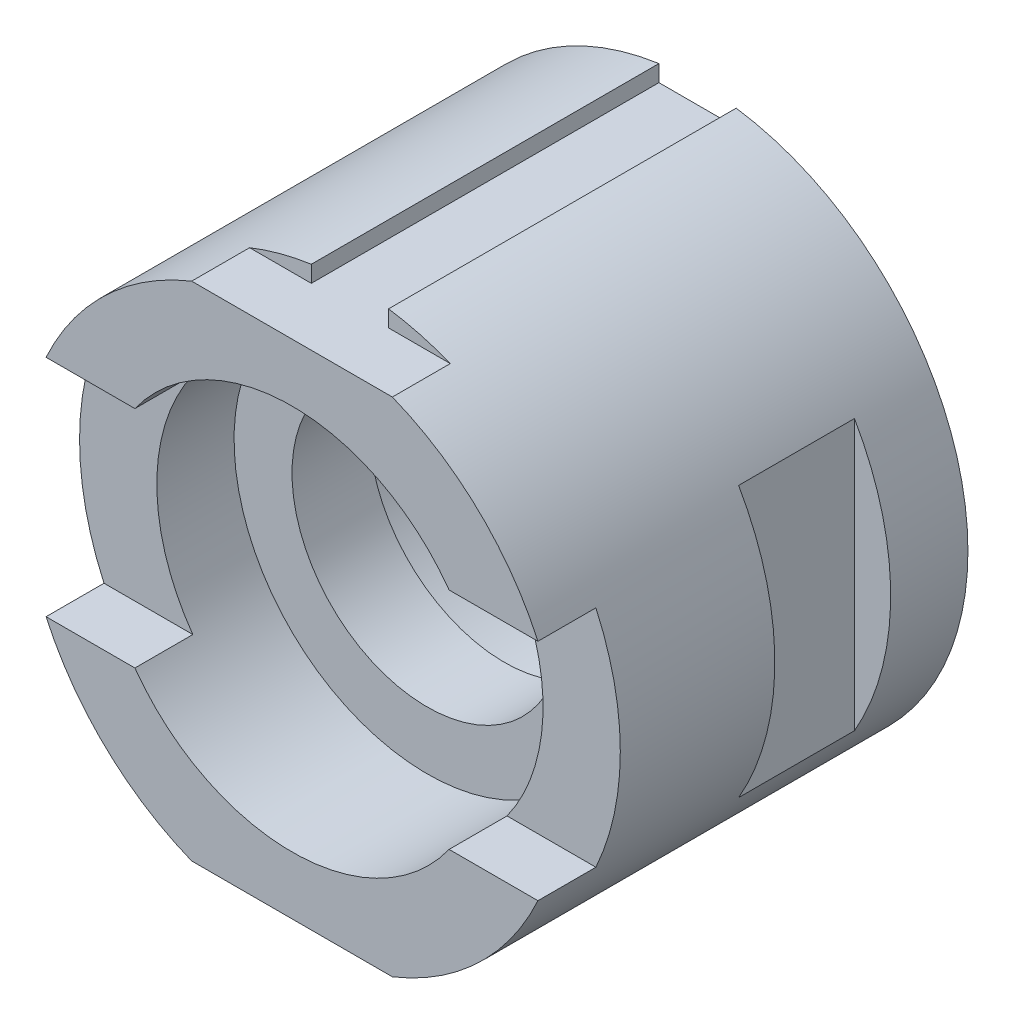
ISO-10303-21;
HEADER;
FILE_DESCRIPTION(('STEP AP214'),'2;1');
FILE_NAME('part.step','',(''),(''),'','','');
FILE_SCHEMA(('AUTOMOTIVE_DESIGN { 1 0 10303 214 1 1 1 1 }'));
ENDSEC;
DATA;
#1=APPLICATION_CONTEXT('core data for automotive mechanical design processes');
#2=APPLICATION_PROTOCOL_DEFINITION('international standard','automotive_design',2000,#1);
#3=PRODUCT_CONTEXT('',#1,'mechanical');
#4=PRODUCT('Part','Part','',(#3));
#5=PRODUCT_RELATED_PRODUCT_CATEGORY('part','',(#4));
#6=PRODUCT_DEFINITION_FORMATION('','',#4);
#7=PRODUCT_DEFINITION_CONTEXT('part definition',#1,'design');
#8=PRODUCT_DEFINITION('design','',#6,#7);
#9=PRODUCT_DEFINITION_SHAPE('','',#8);
#10=(LENGTH_UNIT() NAMED_UNIT(*) SI_UNIT(.MILLI.,.METRE.));
#11=(NAMED_UNIT(*) PLANE_ANGLE_UNIT() SI_UNIT($,.RADIAN.));
#12=(NAMED_UNIT(*) SI_UNIT($,.STERADIAN.) SOLID_ANGLE_UNIT());
#13=UNCERTAINTY_MEASURE_WITH_UNIT(LENGTH_MEASURE(1.E-05),#10,'distance_accuracy_value','');
#14=(GEOMETRIC_REPRESENTATION_CONTEXT(3) GLOBAL_UNCERTAINTY_ASSIGNED_CONTEXT((#13)) GLOBAL_UNIT_ASSIGNED_CONTEXT((#10,
#11,#12)) REPRESENTATION_CONTEXT('',''));
#15=CARTESIAN_POINT('',(0.,0.,0.));
#16=DIRECTION('',(0.,0.,1.));
#17=DIRECTION('',(1.,0.,0.));
#18=AXIS2_PLACEMENT_3D('',#15,#16,#17);
#19=CARTESIAN_POINT('',(0.,0.,10.));
#20=DIRECTION('',(0.,0.,-1.));
#21=DIRECTION('',(-1.,0.,0.));
#22=AXIS2_PLACEMENT_3D('',#19,#20,#21);
#23=CYLINDRICAL_SURFACE('',#22,35.);
#24=CARTESIAN_POINT('',(0.,0.,45.));
#25=DIRECTION('',(0.,0.,1.));
#26=DIRECTION('',(1.,0.,0.));
#27=AXIS2_PLACEMENT_3D('',#24,#25,#26);
#28=CIRCLE('',#27,35.);
#29=CARTESIAN_POINT('',(4.99999999999999,-34.6410161513775,45.));
#30=VERTEX_POINT('',#29);
#31=CARTESIAN_POINT('',(12.9903810567667,-32.4999999999999,45.));
#32=VERTEX_POINT('',#31);
#33=EDGE_CURVE('E275',#30,#32,#28,.T.);
#34=ORIENTED_EDGE('',*,*,#33,.F.);
#35=DIRECTION('',(0.,0.,1.));
#36=VECTOR('',#35,1.);
#37=CARTESIAN_POINT('',(4.99999999999999,-34.6410161513775,-46.));
#38=LINE('',#37,#36);
#39=CARTESIAN_POINT('',(4.99999999999999,-34.6410161513775,0.));
#40=VERTEX_POINT('',#39);
#41=EDGE_CURVE('E47',#40,#30,#38,.T.);
#42=ORIENTED_EDGE('',*,*,#41,.F.);
#43=CARTESIAN_POINT('',(0.,0.,0.));
#44=DIRECTION('',(0.,0.,1.));
#45=DIRECTION('',(1.,0.,0.));
#46=AXIS2_PLACEMENT_3D('',#43,#44,#45);
#47=CIRCLE('',#46,35.);
#48=CARTESIAN_POINT('',(5.00000000000002,34.6410161513775,0.));
#49=VERTEX_POINT('',#48);
#50=EDGE_CURVE('E400',#40,#49,#47,.T.);
#51=ORIENTED_EDGE('',*,*,#50,.T.);
#52=DIRECTION('',(0.,0.,1.));
#53=VECTOR('',#52,1.);
#54=CARTESIAN_POINT('',(5.00000000000002,34.6410161513775,-46.));
#55=LINE('',#54,#53);
#56=CARTESIAN_POINT('',(5.00000000000002,34.6410161513775,45.));
#57=VERTEX_POINT('',#56);
#58=EDGE_CURVE('E238',#49,#57,#55,.T.);
#59=ORIENTED_EDGE('',*,*,#58,.T.);
#60=CARTESIAN_POINT('',(0.,-5.03069808033274E-13,45.));
#61=DIRECTION('',(0.,0.,1.));
#62=DIRECTION('',(-1.,0.,0.));
#63=AXIS2_PLACEMENT_3D('',#60,#61,#62);
#64=CIRCLE('',#63,35.0000000000005);
#65=CARTESIAN_POINT('',(12.9903810567664,32.5000000000001,45.));
#66=VERTEX_POINT('',#65);
#67=EDGE_CURVE('E256',#66,#57,#64,.T.);
#68=ORIENTED_EDGE('',*,*,#67,.F.);
#69=DIRECTION('',(0.,0.,1.));
#70=VECTOR('',#69,1.);
#71=CARTESIAN_POINT('',(12.9903810567664,32.5000000000001,45.));
#72=LINE('',#71,#70);
#73=CARTESIAN_POINT('',(12.9903810567664,32.5000000000001,52.5));
#74=VERTEX_POINT('',#73);
#75=EDGE_CURVE('E266',#66,#74,#72,.T.);
#76=ORIENTED_EDGE('',*,*,#75,.T.);
#77=CARTESIAN_POINT('',(0.,0.,52.5));
#78=DIRECTION('',(0.,0.,1.));
#79=DIRECTION('',(-1.,0.,0.));
#80=AXIS2_PLACEMENT_3D('',#77,#78,#79);
#81=CIRCLE('',#80,35.);
#82=CARTESIAN_POINT('',(31.8369565217392,14.5398830611835,52.5));
#83=VERTEX_POINT('',#82);
#84=EDGE_CURVE('E310',#83,#74,#81,.T.);
#85=ORIENTED_EDGE('',*,*,#84,.F.);
#86=DIRECTION('',(0.,0.,-1.));
#87=VECTOR('',#86,1.);
#88=CARTESIAN_POINT('',(31.8369565217392,14.5398830611835,52.5));
#89=LINE('',#88,#87);
#90=CARTESIAN_POINT('',(31.8369565217392,14.5398830611835,45.));
#91=VERTEX_POINT('',#90);
#92=EDGE_CURVE('E320',#83,#91,#89,.T.);
#93=ORIENTED_EDGE('',*,*,#92,.T.);
#94=CARTESIAN_POINT('',(0.,0.,45.));
#95=DIRECTION('',(0.,0.,1.));
#96=DIRECTION('',(1.,0.,0.));
#97=AXIS2_PLACEMENT_3D('',#94,#95,#96);
#98=CIRCLE('',#97,35.);
#99=CARTESIAN_POINT('',(31.8369565217392,-14.5398830611835,45.));
#100=VERTEX_POINT('',#99);
#101=EDGE_CURVE('E355',#100,#91,#98,.T.);
#102=ORIENTED_EDGE('',*,*,#101,.F.);
#103=DIRECTION('',(0.,0.,-1.));
#104=VECTOR('',#103,1.);
#105=CARTESIAN_POINT('',(31.8369565217392,-14.5398830611835,52.5));
#106=LINE('',#105,#104);
#107=CARTESIAN_POINT('',(31.8369565217392,-14.5398830611835,52.5));
#108=VERTEX_POINT('',#107);
#109=EDGE_CURVE('E307',#108,#100,#106,.T.);
#110=ORIENTED_EDGE('',*,*,#109,.F.);
#111=CARTESIAN_POINT('',(0.,0.,52.5));
#112=DIRECTION('',(0.,0.,1.));
#113=DIRECTION('',(1.,0.,0.));
#114=AXIS2_PLACEMENT_3D('',#111,#112,#113);
#115=CIRCLE('',#114,35.);
#116=CARTESIAN_POINT('',(12.9903810567667,-32.4999999999999,52.5));
#117=VERTEX_POINT('',#116);
#118=EDGE_CURVE('E290',#117,#108,#115,.T.);
#119=ORIENTED_EDGE('',*,*,#118,.F.);
#120=DIRECTION('',(0.,0.,1.));
#121=VECTOR('',#120,1.);
#122=CARTESIAN_POINT('',(12.9903810567667,-32.4999999999999,45.));
#123=LINE('',#122,#121);
#124=EDGE_CURVE('E279',#32,#117,#123,.T.);
#125=ORIENTED_EDGE('',*,*,#124,.F.);
#126=EDGE_LOOP('',(#34,#42,#51,#59,#68,#76,#85,#93,#102,#110,#119,#125));
#127=FACE_BOUND('',#126,.T.);
#128=DIRECTION('',(0.,0.,-1.));
#129=VECTOR('',#128,1.);
#130=CARTESIAN_POINT('',(30.3108891324554,17.5,10.));
#131=LINE('',#130,#129);
#132=CARTESIAN_POINT('',(30.3108891324554,17.5,25.));
#133=VERTEX_POINT('',#132);
#134=CARTESIAN_POINT('',(30.3108891324554,17.5,10.));
#135=VERTEX_POINT('',#134);
#136=EDGE_CURVE('E40',#133,#135,#131,.T.);
#137=ORIENTED_EDGE('',*,*,#136,.T.);
#138=CARTESIAN_POINT('',(0.,0.,10.));
#139=DIRECTION('',(0.,0.,1.));
#140=DIRECTION('',(1.,0.,0.));
#141=AXIS2_PLACEMENT_3D('',#138,#139,#140);
#142=CIRCLE('',#141,35.);
#143=CARTESIAN_POINT('',(30.3108891324554,-17.5,10.));
#144=VERTEX_POINT('',#143);
#145=EDGE_CURVE('E11',#144,#135,#142,.T.);
#146=ORIENTED_EDGE('',*,*,#145,.F.);
#147=DIRECTION('',(0.,0.,-1.));
#148=VECTOR('',#147,1.);
#149=CARTESIAN_POINT('',(30.3108891324554,-17.5,10.));
#150=LINE('',#149,#148);
#151=CARTESIAN_POINT('',(30.3108891324554,-17.5,25.));
#152=VERTEX_POINT('',#151);
#153=EDGE_CURVE('E197',#144,#152,#150,.F.);
#154=ORIENTED_EDGE('',*,*,#153,.T.);
#155=CARTESIAN_POINT('',(0.,0.,25.));
#156=DIRECTION('',(0.,0.,-1.));
#157=DIRECTION('',(-1.,0.,0.));
#158=AXIS2_PLACEMENT_3D('',#155,#156,#157);
#159=CIRCLE('',#158,35.);
#160=EDGE_CURVE('E194',#133,#152,#159,.T.);
#161=ORIENTED_EDGE('',*,*,#160,.F.);
#162=EDGE_LOOP('',(#137,#146,#154,#161));
#163=FACE_BOUND('',#162,.T.);
#164=ADVANCED_FACE('F33',(#127,#163),#23,.T.);
#165=CARTESIAN_POINT('',(0.,0.,10.));
#166=DIRECTION('',(0.,0.,1.));
#167=DIRECTION('',(1.,0.,0.));
#168=AXIS2_PLACEMENT_3D('',#165,#166,#167);
#169=CIRCLE('',#168,35.);
#170=CARTESIAN_POINT('',(-30.3108891324554,17.5,10.));
#171=VERTEX_POINT('',#170);
#172=CARTESIAN_POINT('',(-30.3108891324554,-17.5,10.));
#173=VERTEX_POINT('',#172);
#174=EDGE_CURVE('E368',#171,#173,#169,.T.);
#175=ORIENTED_EDGE('',*,*,#174,.F.);
#176=DIRECTION('',(0.,0.,-1.));
#177=VECTOR('',#176,1.);
#178=CARTESIAN_POINT('',(-30.3108891324554,17.5,25.));
#179=LINE('',#178,#177);
#180=CARTESIAN_POINT('',(-30.3108891324554,17.5,25.));
#181=VERTEX_POINT('',#180);
#182=EDGE_CURVE('E397',#181,#171,#179,.T.);
#183=ORIENTED_EDGE('',*,*,#182,.F.);
#184=CARTESIAN_POINT('',(0.,0.,25.));
#185=DIRECTION('',(0.,0.,1.));
#186=DIRECTION('',(1.,0.,0.));
#187=AXIS2_PLACEMENT_3D('',#184,#185,#186);
#188=CIRCLE('',#187,35.);
#189=CARTESIAN_POINT('',(-30.3108891324554,-17.5,25.));
#190=VERTEX_POINT('',#189);
#191=EDGE_CURVE('E372',#181,#190,#188,.T.);
#192=ORIENTED_EDGE('',*,*,#191,.T.);
#193=DIRECTION('',(0.,0.,-1.));
#194=VECTOR('',#193,1.);
#195=CARTESIAN_POINT('',(-30.3108891324554,-17.5,25.));
#196=LINE('',#195,#194);
#197=EDGE_CURVE('E377',#190,#173,#196,.T.);
#198=ORIENTED_EDGE('',*,*,#197,.T.);
#199=EDGE_LOOP('',(#175,#183,#192,#198));
#200=FACE_BOUND('',#199,.T.);
#201=CARTESIAN_POINT('',(-4.99999999999998,34.6410161513775,0.));
#202=VERTEX_POINT('',#201);
#203=CARTESIAN_POINT('',(-5.00000000000001,-34.6410161513775,0.));
#204=VERTEX_POINT('',#203);
#205=EDGE_CURVE('E388',#202,#204,#47,.T.);
#206=ORIENTED_EDGE('',*,*,#205,.T.);
#207=DIRECTION('',(0.,0.,1.));
#208=VECTOR('',#207,1.);
#209=CARTESIAN_POINT('',(-5.00000000000001,-34.6410161513775,-46.));
#210=LINE('',#209,#208);
#211=CARTESIAN_POINT('',(-5.00000000000001,-34.6410161513775,45.));
#212=VERTEX_POINT('',#211);
#213=EDGE_CURVE('E217',#204,#212,#210,.T.);
#214=ORIENTED_EDGE('',*,*,#213,.T.);
#215=CARTESIAN_POINT('',(-12.9903810567667,-32.4999999999999,45.));
#216=VERTEX_POINT('',#215);
#217=EDGE_CURVE('E271',#216,#212,#28,.T.);
#218=ORIENTED_EDGE('',*,*,#217,.F.);
#219=DIRECTION('',(0.,0.,1.));
#220=VECTOR('',#219,1.);
#221=CARTESIAN_POINT('',(-12.9903810567667,-32.4999999999999,45.));
#222=LINE('',#221,#220);
#223=CARTESIAN_POINT('',(-12.9903810567667,-32.4999999999999,52.5));
#224=VERTEX_POINT('',#223);
#225=EDGE_CURVE('E281',#216,#224,#222,.T.);
#226=ORIENTED_EDGE('',*,*,#225,.T.);
#227=CARTESIAN_POINT('',(-31.8369565217392,-14.5398830611835,52.5));
#228=VERTEX_POINT('',#227);
#229=EDGE_CURVE('E286',#228,#224,#115,.T.);
#230=ORIENTED_EDGE('',*,*,#229,.F.);
#231=DIRECTION('',(0.,0.,-1.));
#232=VECTOR('',#231,1.);
#233=CARTESIAN_POINT('',(-31.8369565217392,-14.5398830611835,52.5));
#234=LINE('',#233,#232);
#235=CARTESIAN_POINT('',(-31.8369565217392,-14.5398830611835,45.));
#236=VERTEX_POINT('',#235);
#237=EDGE_CURVE('E296',#228,#236,#234,.T.);
#238=ORIENTED_EDGE('',*,*,#237,.T.);
#239=CARTESIAN_POINT('',(-31.8369565217392,14.5398830611835,45.));
#240=VERTEX_POINT('',#239);
#241=EDGE_CURVE('E359',#240,#236,#98,.T.);
#242=ORIENTED_EDGE('',*,*,#241,.F.);
#243=DIRECTION('',(0.,0.,-1.));
#244=VECTOR('',#243,1.);
#245=CARTESIAN_POINT('',(-31.8369565217392,14.5398830611835,52.5));
#246=LINE('',#245,#244);
#247=CARTESIAN_POINT('',(-31.8369565217392,14.5398830611835,52.5));
#248=VERTEX_POINT('',#247);
#249=EDGE_CURVE('E335',#248,#240,#246,.T.);
#250=ORIENTED_EDGE('',*,*,#249,.F.);
#251=CARTESIAN_POINT('',(-12.9903810567664,32.5000000000001,52.5));
#252=VERTEX_POINT('',#251);
#253=EDGE_CURVE('E314',#252,#248,#81,.T.);
#254=ORIENTED_EDGE('',*,*,#253,.F.);
#255=DIRECTION('',(0.,0.,1.));
#256=VECTOR('',#255,1.);
#257=CARTESIAN_POINT('',(-12.9903810567664,32.5000000000001,45.));
#258=LINE('',#257,#256);
#259=CARTESIAN_POINT('',(-12.9903810567664,32.5000000000001,45.));
#260=VERTEX_POINT('',#259);
#261=EDGE_CURVE('E264',#260,#252,#258,.T.);
#262=ORIENTED_EDGE('',*,*,#261,.F.);
#263=CARTESIAN_POINT('',(-4.99999999999998,34.6410161513775,45.));
#264=VERTEX_POINT('',#263);
#265=EDGE_CURVE('E260',#264,#260,#64,.T.);
#266=ORIENTED_EDGE('',*,*,#265,.F.);
#267=DIRECTION('',(0.,0.,1.));
#268=VECTOR('',#267,1.);
#269=CARTESIAN_POINT('',(-4.99999999999998,34.6410161513775,-46.));
#270=LINE('',#269,#268);
#271=EDGE_CURVE('E55',#202,#264,#270,.T.);
#272=ORIENTED_EDGE('',*,*,#271,.F.);
#273=EDGE_LOOP('',(#206,#214,#218,#226,#230,#238,#242,#250,#254,#262,#266,#272));
#274=FACE_BOUND('',#273,.T.);
#275=ADVANCED_FACE('F415',(#200,#274),#23,.T.);
#276=CARTESIAN_POINT('',(0.,0.,45.));
#277=DIRECTION('',(0.,0.,1.));
#278=DIRECTION('',(1.,0.,0.));
#279=AXIS2_PLACEMENT_3D('',#276,#277,#278);
#280=PLANE('',#279);
#281=DIRECTION('',(0.,-1.,0.));
#282=VECTOR('',#281,1.);
#283=CARTESIAN_POINT('',(-5.00000000000001,-34.6410161513775,45.));
#284=LINE('',#283,#282);
#285=CARTESIAN_POINT('',(-5.00000000000001,-32.4999999999999,45.));
#286=VERTEX_POINT('',#285);
#287=EDGE_CURVE('E215',#286,#212,#284,.T.);
#288=ORIENTED_EDGE('',*,*,#287,.F.);
#289=DIRECTION('',(-1.,0.,0.));
#290=VECTOR('',#289,1.);
#291=CARTESIAN_POINT('',(-12.9903810567667,-32.4999999999999,45.));
#292=LINE('',#291,#290);
#293=EDGE_CURVE('E274',#286,#216,#292,.T.);
#294=ORIENTED_EDGE('',*,*,#293,.T.);
#295=ORIENTED_EDGE('',*,*,#217,.T.);
#296=EDGE_LOOP('',(#288,#294,#295));
#297=FACE_BOUND('',#296,.T.);
#298=ADVANCED_FACE('F449',(#297),#280,.T.);
#299=CARTESIAN_POINT('',(0.,-5.03069808033274E-13,45.));
#300=DIRECTION('',(0.,0.,-1.));
#301=DIRECTION('',(-1.,0.,0.));
#302=AXIS2_PLACEMENT_3D('',#299,#300,#301);
#303=PLANE('',#302);
#304=ORIENTED_EDGE('',*,*,#67,.T.);
#305=DIRECTION('',(0.,1.,0.));
#306=VECTOR('',#305,1.);
#307=CARTESIAN_POINT('',(5.,32.5000000000001,45.));
#308=LINE('',#307,#306);
#309=CARTESIAN_POINT('',(5.,32.5000000000001,45.));
#310=VERTEX_POINT('',#309);
#311=EDGE_CURVE('E236',#310,#57,#308,.T.);
#312=ORIENTED_EDGE('',*,*,#311,.F.);
#313=DIRECTION('',(1.,0.,0.));
#314=VECTOR('',#313,1.);
#315=CARTESIAN_POINT('',(-12.9903810567664,32.5000000000001,45.));
#316=LINE('',#315,#314);
#317=EDGE_CURVE('E259',#310,#66,#316,.T.);
#318=ORIENTED_EDGE('',*,*,#317,.T.);
#319=EDGE_LOOP('',(#304,#312,#318));
#320=FACE_BOUND('',#319,.T.);
#321=ADVANCED_FACE('F487',(#320),#303,.F.);
#322=CARTESIAN_POINT('',(0.,0.,45.));
#323=DIRECTION('',(0.,0.,1.));
#324=DIRECTION('',(1.,0.,0.));
#325=AXIS2_PLACEMENT_3D('',#322,#323,#324);
#326=PLANE('',#325);
#327=CARTESIAN_POINT('',(0.,0.,45.));
#328=DIRECTION('',(0.,0.,1.));
#329=DIRECTION('',(1.,0.,0.));
#330=AXIS2_PLACEMENT_3D('',#327,#328,#329);
#331=CIRCLE('',#330,25.);
#332=CARTESIAN_POINT('',(20.3369565217391,-14.5398830611835,45.));
#333=VERTEX_POINT('',#332);
#334=CARTESIAN_POINT('',(20.3369565217392,14.5398830611835,45.));
#335=VERTEX_POINT('',#334);
#336=EDGE_CURVE('E341',#333,#335,#331,.T.);
#337=ORIENTED_EDGE('',*,*,#336,.F.);
#338=DIRECTION('',(-1.,0.,0.));
#339=VECTOR('',#338,1.);
#340=CARTESIAN_POINT('',(20.3369565217392,-14.5398830611835,45.));
#341=LINE('',#340,#339);
#342=EDGE_CURVE('E284',#100,#333,#341,.T.);
#343=ORIENTED_EDGE('',*,*,#342,.F.);
#344=ORIENTED_EDGE('',*,*,#101,.T.);
#345=DIRECTION('',(1.,0.,0.));
#346=VECTOR('',#345,1.);
#347=CARTESIAN_POINT('',(20.3369565217392,14.5398830611835,45.));
#348=LINE('',#347,#346);
#349=EDGE_CURVE('E329',#335,#91,#348,.T.);
#350=ORIENTED_EDGE('',*,*,#349,.F.);
#351=EDGE_LOOP('',(#337,#343,#344,#350));
#352=FACE_BOUND('',#351,.T.);
#353=ADVANCED_FACE('F523',(#352),#326,.T.);
#354=ORIENTED_EDGE('',*,*,#241,.T.);
#355=DIRECTION('',(-1.,0.,0.));
#356=VECTOR('',#355,1.);
#357=CARTESIAN_POINT('',(-31.8369565217392,-14.5398830611835,45.));
#358=LINE('',#357,#356);
#359=CARTESIAN_POINT('',(-20.3369565217392,-14.5398830611835,45.));
#360=VERTEX_POINT('',#359);
#361=EDGE_CURVE('E299',#360,#236,#358,.T.);
#362=ORIENTED_EDGE('',*,*,#361,.F.);
#363=CARTESIAN_POINT('',(-20.3369565217392,14.5398830611835,45.));
#364=VERTEX_POINT('',#363);
#365=EDGE_CURVE('E330',#364,#360,#331,.T.);
#366=ORIENTED_EDGE('',*,*,#365,.F.);
#367=DIRECTION('',(1.,0.,0.));
#368=VECTOR('',#367,1.);
#369=CARTESIAN_POINT('',(-31.8369565217392,14.5398830611835,45.));
#370=LINE('',#369,#368);
#371=EDGE_CURVE('E309',#240,#364,#370,.T.);
#372=ORIENTED_EDGE('',*,*,#371,.F.);
#373=EDGE_LOOP('',(#354,#362,#366,#372));
#374=FACE_BOUND('',#373,.T.);
#375=ADVANCED_FACE('F525',(#374),#326,.T.);
#376=CARTESIAN_POINT('',(0.,0.,10.));
#377=DIRECTION('',(0.,0.,1.));
#378=DIRECTION('',(1.,0.,0.));
#379=AXIS2_PLACEMENT_3D('',#376,#377,#378);
#380=PLANE('',#379);
#381=DIRECTION('',(0.,-1.,0.));
#382=VECTOR('',#381,1.);
#383=CARTESIAN_POINT('',(-30.3108891324554,17.5,10.));
#384=LINE('',#383,#382);
#385=EDGE_CURVE('E378',#171,#173,#384,.T.);
#386=ORIENTED_EDGE('',*,*,#385,.F.);
#387=ORIENTED_EDGE('',*,*,#174,.T.);
#388=EDGE_LOOP('',(#386,#387));
#389=FACE_BOUND('',#388,.T.);
#390=ADVANCED_FACE('F411',(#389),#380,.T.);
#391=CARTESIAN_POINT('',(0.,0.,0.));
#392=DIRECTION('',(0.,0.,1.));
#393=DIRECTION('',(1.,0.,0.));
#394=AXIS2_PLACEMENT_3D('',#391,#392,#393);
#395=PLANE('',#394);
#396=CARTESIAN_POINT('',(0.,0.,0.));
#397=DIRECTION('',(0.,0.,1.));
#398=DIRECTION('',(1.,0.,0.));
#399=AXIS2_PLACEMENT_3D('',#396,#397,#398);
#400=CIRCLE('',#399,25.);
#401=CARTESIAN_POINT('',(25.,0.,0.));
#402=VERTEX_POINT('',#401);
#403=EDGE_CURVE('E384',#402,#402,#400,.T.);
#404=ORIENTED_EDGE('',*,*,#403,.T.);
#405=EDGE_LOOP('',(#404));
#406=FACE_BOUND('',#405,.T.);
#407=DIRECTION('',(-1.,0.,0.));
#408=VECTOR('',#407,1.);
#409=CARTESIAN_POINT('',(0.,-32.4999999999999,0.));
#410=LINE('',#409,#408);
#411=CARTESIAN_POINT('',(4.99999999999999,-32.4999999999999,0.));
#412=VERTEX_POINT('',#411);
#413=CARTESIAN_POINT('',(-5.00000000000001,-32.4999999999999,0.));
#414=VERTEX_POINT('',#413);
#415=EDGE_CURVE('E228',#412,#414,#410,.T.);
#416=ORIENTED_EDGE('',*,*,#415,.T.);
#417=DIRECTION('',(0.,-1.,0.));
#418=VECTOR('',#417,1.);
#419=CARTESIAN_POINT('',(-5.00000000000001,0.,0.));
#420=LINE('',#419,#418);
#421=EDGE_CURVE('E231',#414,#204,#420,.T.);
#422=ORIENTED_EDGE('',*,*,#421,.T.);
#423=ORIENTED_EDGE('',*,*,#205,.F.);
#424=DIRECTION('',(0.,-1.,0.));
#425=VECTOR('',#424,1.);
#426=CARTESIAN_POINT('',(-5.00000000000038,0.,0.));
#427=LINE('',#426,#425);
#428=CARTESIAN_POINT('',(-5.,32.5000000000001,0.));
#429=VERTEX_POINT('',#428);
#430=EDGE_CURVE('E241',#202,#429,#427,.T.);
#431=ORIENTED_EDGE('',*,*,#430,.T.);
#432=DIRECTION('',(1.,0.,0.));
#433=VECTOR('',#432,1.);
#434=CARTESIAN_POINT('',(0.,32.5000000000001,0.));
#435=LINE('',#434,#433);
#436=CARTESIAN_POINT('',(5.,32.5000000000001,0.));
#437=VERTEX_POINT('',#436);
#438=EDGE_CURVE('E249',#429,#437,#435,.T.);
#439=ORIENTED_EDGE('',*,*,#438,.T.);
#440=DIRECTION('',(0.,1.,0.));
#441=VECTOR('',#440,1.);
#442=CARTESIAN_POINT('',(4.99999999999962,0.,0.));
#443=LINE('',#442,#441);
#444=EDGE_CURVE('E252',#437,#49,#443,.T.);
#445=ORIENTED_EDGE('',*,*,#444,.T.);
#446=ORIENTED_EDGE('',*,*,#50,.F.);
#447=DIRECTION('',(0.,1.,0.));
#448=VECTOR('',#447,1.);
#449=CARTESIAN_POINT('',(4.99999999999999,0.,0.));
#450=LINE('',#449,#448);
#451=EDGE_CURVE('E220',#40,#412,#450,.T.);
#452=ORIENTED_EDGE('',*,*,#451,.T.);
#453=EDGE_LOOP('',(#416,#422,#423,#431,#439,#445,#446,#452));
#454=FACE_BOUND('',#453,.T.);
#455=ADVANCED_FACE('F538',(#406,#454),#395,.F.);
#456=CARTESIAN_POINT('',(-30.3108891324554,17.5,25.));
#457=DIRECTION('',(1.,0.,0.));
#458=DIRECTION('',(0.,0.,-1.));
#459=AXIS2_PLACEMENT_3D('',#456,#457,#458);
#460=PLANE('',#459);
#461=ORIENTED_EDGE('',*,*,#385,.T.);
#462=ORIENTED_EDGE('',*,*,#197,.F.);
#463=DIRECTION('',(0.,-1.,0.));
#464=VECTOR('',#463,1.);
#465=CARTESIAN_POINT('',(-30.3108891324554,17.5,25.));
#466=LINE('',#465,#464);
#467=EDGE_CURVE('E373',#181,#190,#466,.T.);
#468=ORIENTED_EDGE('',*,*,#467,.F.);
#469=ORIENTED_EDGE('',*,*,#182,.T.);
#470=EDGE_LOOP('',(#461,#462,#468,#469));
#471=FACE_BOUND('',#470,.T.);
#472=ADVANCED_FACE('F413',(#471),#460,.F.);
#473=CARTESIAN_POINT('',(0.,0.,-33.));
#474=DIRECTION('',(0.,0.,1.));
#475=DIRECTION('',(1.,0.,0.));
#476=AXIS2_PLACEMENT_3D('',#473,#474,#475);
#477=CYLINDRICAL_SURFACE('',#476,25.);
#478=CARTESIAN_POINT('',(0.,0.,25.));
#479=DIRECTION('',(0.,0.,1.));
#480=DIRECTION('',(1.,0.,0.));
#481=AXIS2_PLACEMENT_3D('',#478,#479,#480);
#482=CIRCLE('',#481,25.);
#483=CARTESIAN_POINT('',(25.,0.,25.));
#484=VERTEX_POINT('',#483);
#485=EDGE_CURVE('E418',#484,#484,#482,.T.);
#486=ORIENTED_EDGE('',*,*,#485,.T.);
#487=EDGE_LOOP('',(#486));
#488=FACE_BOUND('',#487,.T.);
#489=ORIENTED_EDGE('',*,*,#403,.F.);
#490=EDGE_LOOP('',(#489));
#491=FACE_BOUND('',#490,.T.);
#492=ADVANCED_FACE('F432',(#488,#491),#477,.F.);
#493=CARTESIAN_POINT('',(0.,0.,35.));
#494=DIRECTION('',(0.,0.,1.));
#495=DIRECTION('',(1.,0.,0.));
#496=AXIS2_PLACEMENT_3D('',#493,#494,#495);
#497=PLANE('',#496);
#498=CARTESIAN_POINT('',(0.,0.,35.));
#499=DIRECTION('',(0.,0.,1.));
#500=DIRECTION('',(1.,0.,0.));
#501=AXIS2_PLACEMENT_3D('',#498,#499,#500);
#502=CIRCLE('',#501,25.);
#503=CARTESIAN_POINT('',(25.,0.,35.));
#504=VERTEX_POINT('',#503);
#505=EDGE_CURVE('E201',#504,#504,#502,.F.);
#506=ORIENTED_EDGE('',*,*,#505,.F.);
#507=EDGE_LOOP('',(#506));
#508=FACE_BOUND('',#507,.T.);
#509=CARTESIAN_POINT('',(0.,0.,35.));
#510=DIRECTION('',(0.,0.,1.));
#511=DIRECTION('',(1.,0.,0.));
#512=AXIS2_PLACEMENT_3D('',#509,#510,#511);
#513=CIRCLE('',#512,17.5);
#514=CARTESIAN_POINT('',(17.5,0.,35.));
#515=VERTEX_POINT('',#514);
#516=EDGE_CURVE('E362',#515,#515,#513,.T.);
#517=ORIENTED_EDGE('',*,*,#516,.F.);
#518=EDGE_LOOP('',(#517));
#519=FACE_BOUND('',#518,.T.);
#520=ADVANCED_FACE('F429',(#508,#519),#497,.T.);
#521=CARTESIAN_POINT('',(0.,0.,25.));
#522=DIRECTION('',(0.,0.,1.));
#523=DIRECTION('',(1.,0.,0.));
#524=AXIS2_PLACEMENT_3D('',#521,#522,#523);
#525=PLANE('',#524);
#526=ORIENTED_EDGE('',*,*,#191,.F.);
#527=ORIENTED_EDGE('',*,*,#467,.T.);
#528=EDGE_LOOP('',(#526,#527));
#529=FACE_BOUND('',#528,.T.);
#530=ADVANCED_FACE('F431',(#529),#525,.F.);
#531=CARTESIAN_POINT('',(0.,0.,25.));
#532=DIRECTION('',(0.,0.,1.));
#533=DIRECTION('',(1.,0.,0.));
#534=AXIS2_PLACEMENT_3D('',#531,#532,#533);
#535=CIRCLE('',#534,17.5);
#536=CARTESIAN_POINT('',(17.5,0.,25.));
#537=VERTEX_POINT('',#536);
#538=EDGE_CURVE('E369',#537,#537,#535,.T.);
#539=ORIENTED_EDGE('',*,*,#538,.T.);
#540=EDGE_LOOP('',(#539));
#541=FACE_BOUND('',#540,.T.);
#542=ORIENTED_EDGE('',*,*,#485,.F.);
#543=EDGE_LOOP('',(#542));
#544=FACE_BOUND('',#543,.T.);
#545=ADVANCED_FACE('F439',(#541,#544),#525,.F.);
#546=CARTESIAN_POINT('',(0.,0.,-166.5));
#547=DIRECTION('',(0.,0.,1.));
#548=DIRECTION('',(1.,0.,0.));
#549=AXIS2_PLACEMENT_3D('',#546,#547,#548);
#550=CYLINDRICAL_SURFACE('',#549,17.5);
#551=ORIENTED_EDGE('',*,*,#516,.T.);
#552=EDGE_LOOP('',(#551));
#553=FACE_BOUND('',#552,.T.);
#554=ORIENTED_EDGE('',*,*,#538,.F.);
#555=EDGE_LOOP('',(#554));
#556=FACE_BOUND('',#555,.T.);
#557=ADVANCED_FACE('F426',(#553,#556),#550,.F.);
#558=CARTESIAN_POINT('',(0.,0.,45.));
#559=DIRECTION('',(0.,0.,-1.));
#560=DIRECTION('',(-1.,0.,0.));
#561=AXIS2_PLACEMENT_3D('',#558,#559,#560);
#562=CYLINDRICAL_SURFACE('',#561,25.);
#563=ORIENTED_EDGE('',*,*,#365,.T.);
#564=DIRECTION('',(0.,0.,-1.));
#565=VECTOR('',#564,1.);
#566=CARTESIAN_POINT('',(-20.3369565217392,-14.5398830611835,52.5));
#567=LINE('',#566,#565);
#568=CARTESIAN_POINT('',(-20.3369565217392,-14.5398830611835,52.5));
#569=VERTEX_POINT('',#568);
#570=EDGE_CURVE('E303',#569,#360,#567,.T.);
#571=ORIENTED_EDGE('',*,*,#570,.F.);
#572=CARTESIAN_POINT('',(0.,1.75207071073658E-13,52.5));
#573=DIRECTION('',(0.,0.,-1.));
#574=DIRECTION('',(1.,0.,0.));
#575=AXIS2_PLACEMENT_3D('',#572,#573,#574);
#576=CIRCLE('',#575,25.0000000000001);
#577=CARTESIAN_POINT('',(20.3369565217391,-14.5398830611835,52.5));
#578=VERTEX_POINT('',#577);
#579=EDGE_CURVE('E292',#578,#569,#576,.T.);
#580=ORIENTED_EDGE('',*,*,#579,.F.);
#581=DIRECTION('',(0.,0.,-1.));
#582=VECTOR('',#581,1.);
#583=CARTESIAN_POINT('',(20.3369565217391,-14.5398830611835,52.5));
#584=LINE('',#583,#582);
#585=EDGE_CURVE('E305',#578,#333,#584,.T.);
#586=ORIENTED_EDGE('',*,*,#585,.T.);
#587=ORIENTED_EDGE('',*,*,#336,.T.);
#588=DIRECTION('',(0.,0.,-1.));
#589=VECTOR('',#588,1.);
#590=CARTESIAN_POINT('',(20.3369565217392,14.5398830611835,52.5));
#591=LINE('',#590,#589);
#592=CARTESIAN_POINT('',(20.3369565217392,14.5398830611835,52.5));
#593=VERTEX_POINT('',#592);
#594=EDGE_CURVE('E336',#593,#335,#591,.T.);
#595=ORIENTED_EDGE('',*,*,#594,.F.);
#596=CARTESIAN_POINT('',(0.,0.,52.5));
#597=DIRECTION('',(0.,0.,-1.));
#598=DIRECTION('',(-1.,0.,0.));
#599=AXIS2_PLACEMENT_3D('',#596,#597,#598);
#600=CIRCLE('',#599,25.);
#601=CARTESIAN_POINT('',(-20.3369565217392,14.5398830611835,52.5));
#602=VERTEX_POINT('',#601);
#603=EDGE_CURVE('E316',#602,#593,#600,.T.);
#604=ORIENTED_EDGE('',*,*,#603,.F.);
#605=DIRECTION('',(0.,0.,-1.));
#606=VECTOR('',#605,1.);
#607=CARTESIAN_POINT('',(-20.3369565217392,14.5398830611835,52.5));
#608=LINE('',#607,#606);
#609=EDGE_CURVE('E332',#602,#364,#608,.T.);
#610=ORIENTED_EDGE('',*,*,#609,.T.);
#611=EDGE_LOOP('',(#563,#571,#580,#586,#587,#595,#604,#610));
#612=FACE_BOUND('',#611,.T.);
#613=ORIENTED_EDGE('',*,*,#505,.T.);
#614=EDGE_LOOP('',(#613));
#615=FACE_BOUND('',#614,.T.);
#616=ADVANCED_FACE('F518',(#612,#615),#562,.F.);
#617=CARTESIAN_POINT('',(-31.8369565217392,14.5398830611835,52.5));
#618=DIRECTION('',(0.,1.,0.));
#619=DIRECTION('',(0.,0.,1.));
#620=AXIS2_PLACEMENT_3D('',#617,#618,#619);
#621=PLANE('',#620);
#622=ORIENTED_EDGE('',*,*,#371,.T.);
#623=ORIENTED_EDGE('',*,*,#609,.F.);
#624=DIRECTION('',(1.,0.,0.));
#625=VECTOR('',#624,1.);
#626=CARTESIAN_POINT('',(-31.8369565217392,14.5398830611835,52.5));
#627=LINE('',#626,#625);
#628=EDGE_CURVE('E313',#248,#602,#627,.T.);
#629=ORIENTED_EDGE('',*,*,#628,.F.);
#630=ORIENTED_EDGE('',*,*,#249,.T.);
#631=EDGE_LOOP('',(#622,#623,#629,#630));
#632=FACE_BOUND('',#631,.T.);
#633=ADVANCED_FACE('F514',(#632),#621,.F.);
#634=CARTESIAN_POINT('',(20.3369565217392,14.5398830611835,52.5));
#635=DIRECTION('',(0.,1.,0.));
#636=DIRECTION('',(0.,0.,1.));
#637=AXIS2_PLACEMENT_3D('',#634,#635,#636);
#638=PLANE('',#637);
#639=ORIENTED_EDGE('',*,*,#349,.T.);
#640=ORIENTED_EDGE('',*,*,#92,.F.);
#641=DIRECTION('',(1.,0.,0.));
#642=VECTOR('',#641,1.);
#643=CARTESIAN_POINT('',(20.3369565217392,14.5398830611835,52.5));
#644=LINE('',#643,#642);
#645=EDGE_CURVE('E318',#593,#83,#644,.T.);
#646=ORIENTED_EDGE('',*,*,#645,.F.);
#647=ORIENTED_EDGE('',*,*,#594,.T.);
#648=EDGE_LOOP('',(#639,#640,#646,#647));
#649=FACE_BOUND('',#648,.T.);
#650=ADVANCED_FACE('F510',(#649),#638,.F.);
#651=CARTESIAN_POINT('',(0.,0.,52.5));
#652=DIRECTION('',(0.,0.,-1.));
#653=DIRECTION('',(-1.,0.,0.));
#654=AXIS2_PLACEMENT_3D('',#651,#652,#653);
#655=PLANE('',#654);
#656=ORIENTED_EDGE('',*,*,#84,.T.);
#657=DIRECTION('',(1.,0.,0.));
#658=VECTOR('',#657,1.);
#659=CARTESIAN_POINT('',(-12.9903810567664,32.5000000000001,52.5));
#660=LINE('',#659,#658);
#661=EDGE_CURVE('E255',#252,#74,#660,.T.);
#662=ORIENTED_EDGE('',*,*,#661,.F.);
#663=ORIENTED_EDGE('',*,*,#253,.T.);
#664=ORIENTED_EDGE('',*,*,#628,.T.);
#665=ORIENTED_EDGE('',*,*,#603,.T.);
#666=ORIENTED_EDGE('',*,*,#645,.T.);
#667=EDGE_LOOP('',(#656,#662,#663,#664,#665,#666));
#668=FACE_BOUND('',#667,.T.);
#669=ADVANCED_FACE('F506',(#668),#655,.F.);
#670=CARTESIAN_POINT('',(20.3369565217392,-14.5398830611835,52.5));
#671=DIRECTION('',(0.,-1.,0.));
#672=DIRECTION('',(1.,0.,0.));
#673=AXIS2_PLACEMENT_3D('',#670,#671,#672);
#674=PLANE('',#673);
#675=ORIENTED_EDGE('',*,*,#342,.T.);
#676=ORIENTED_EDGE('',*,*,#585,.F.);
#677=DIRECTION('',(-1.,0.,0.));
#678=VECTOR('',#677,1.);
#679=CARTESIAN_POINT('',(20.3369565217392,-14.5398830611835,52.5));
#680=LINE('',#679,#678);
#681=EDGE_CURVE('E289',#108,#578,#680,.T.);
#682=ORIENTED_EDGE('',*,*,#681,.F.);
#683=ORIENTED_EDGE('',*,*,#109,.T.);
#684=EDGE_LOOP('',(#675,#676,#682,#683));
#685=FACE_BOUND('',#684,.T.);
#686=ADVANCED_FACE('F502',(#685),#674,.F.);
#687=CARTESIAN_POINT('',(-31.8369565217392,-14.5398830611835,52.5));
#688=DIRECTION('',(0.,-1.,0.));
#689=DIRECTION('',(0.,0.,-1.));
#690=AXIS2_PLACEMENT_3D('',#687,#688,#689);
#691=PLANE('',#690);
#692=ORIENTED_EDGE('',*,*,#361,.T.);
#693=ORIENTED_EDGE('',*,*,#237,.F.);
#694=DIRECTION('',(-1.,0.,0.));
#695=VECTOR('',#694,1.);
#696=CARTESIAN_POINT('',(-31.8369565217392,-14.5398830611835,52.5));
#697=LINE('',#696,#695);
#698=EDGE_CURVE('E294',#569,#228,#697,.T.);
#699=ORIENTED_EDGE('',*,*,#698,.F.);
#700=ORIENTED_EDGE('',*,*,#570,.T.);
#701=EDGE_LOOP('',(#692,#693,#699,#700));
#702=FACE_BOUND('',#701,.T.);
#703=ADVANCED_FACE('F498',(#702),#691,.F.);
#704=CARTESIAN_POINT('',(0.,0.,52.5));
#705=DIRECTION('',(0.,0.,1.));
#706=DIRECTION('',(1.,0.,0.));
#707=AXIS2_PLACEMENT_3D('',#704,#705,#706);
#708=PLANE('',#707);
#709=DIRECTION('',(-1.,0.,0.));
#710=VECTOR('',#709,1.);
#711=CARTESIAN_POINT('',(-12.9903810567667,-32.4999999999999,52.5));
#712=LINE('',#711,#710);
#713=EDGE_CURVE('E269',#117,#224,#712,.T.);
#714=ORIENTED_EDGE('',*,*,#713,.F.);
#715=ORIENTED_EDGE('',*,*,#118,.T.);
#716=ORIENTED_EDGE('',*,*,#681,.T.);
#717=ORIENTED_EDGE('',*,*,#579,.T.);
#718=ORIENTED_EDGE('',*,*,#698,.T.);
#719=ORIENTED_EDGE('',*,*,#229,.T.);
#720=EDGE_LOOP('',(#714,#715,#716,#717,#718,#719));
#721=FACE_BOUND('',#720,.T.);
#722=ADVANCED_FACE('F495',(#721),#708,.T.);
#723=CARTESIAN_POINT('',(-12.9903810567667,-32.4999999999999,45.));
#724=DIRECTION('',(0.,1.,0.));
#725=DIRECTION('',(0.,0.,1.));
#726=AXIS2_PLACEMENT_3D('',#723,#724,#725);
#727=PLANE('',#726);
#728=ORIENTED_EDGE('',*,*,#713,.T.);
#729=ORIENTED_EDGE('',*,*,#225,.F.);
#730=ORIENTED_EDGE('',*,*,#293,.F.);
#731=DIRECTION('',(0.,0.,1.));
#732=VECTOR('',#731,1.);
#733=CARTESIAN_POINT('',(-5.00000000000001,-32.4999999999999,-46.));
#734=LINE('',#733,#732);
#735=EDGE_CURVE('E221',#414,#286,#734,.T.);
#736=ORIENTED_EDGE('',*,*,#735,.F.);
#737=ORIENTED_EDGE('',*,*,#415,.F.);
#738=DIRECTION('',(0.,0.,1.));
#739=VECTOR('',#738,1.);
#740=CARTESIAN_POINT('',(4.99999999999999,-32.4999999999999,-46.));
#741=LINE('',#740,#739);
#742=CARTESIAN_POINT('',(4.99999999999999,-32.4999999999999,45.));
#743=VERTEX_POINT('',#742);
#744=EDGE_CURVE('E223',#412,#743,#741,.T.);
#745=ORIENTED_EDGE('',*,*,#744,.T.);
#746=EDGE_CURVE('E276',#32,#743,#292,.T.);
#747=ORIENTED_EDGE('',*,*,#746,.F.);
#748=ORIENTED_EDGE('',*,*,#124,.T.);
#749=EDGE_LOOP('',(#728,#729,#730,#736,#737,#745,#747,#748));
#750=FACE_BOUND('',#749,.T.);
#751=ADVANCED_FACE('F457',(#750),#727,.F.);
#752=DIRECTION('',(0.,1.,0.));
#753=VECTOR('',#752,1.);
#754=CARTESIAN_POINT('',(4.99999999999999,-32.4999999999999,45.));
#755=LINE('',#754,#753);
#756=EDGE_CURVE('E211',#30,#743,#755,.T.);
#757=ORIENTED_EDGE('',*,*,#756,.F.);
#758=ORIENTED_EDGE('',*,*,#33,.T.);
#759=ORIENTED_EDGE('',*,*,#746,.T.);
#760=EDGE_LOOP('',(#757,#758,#759));
#761=FACE_BOUND('',#760,.T.);
#762=ADVANCED_FACE('F455',(#761),#280,.T.);
#763=CARTESIAN_POINT('',(-12.9903810567664,32.5000000000001,45.));
#764=DIRECTION('',(0.,-1.,0.));
#765=DIRECTION('',(0.,0.,-1.));
#766=AXIS2_PLACEMENT_3D('',#763,#764,#765);
#767=PLANE('',#766);
#768=ORIENTED_EDGE('',*,*,#661,.T.);
#769=ORIENTED_EDGE('',*,*,#75,.F.);
#770=ORIENTED_EDGE('',*,*,#317,.F.);
#771=DIRECTION('',(0.,0.,1.));
#772=VECTOR('',#771,1.);
#773=CARTESIAN_POINT('',(5.,32.5000000000001,-46.));
#774=LINE('',#773,#772);
#775=EDGE_CURVE('E242',#437,#310,#774,.T.);
#776=ORIENTED_EDGE('',*,*,#775,.F.);
#777=ORIENTED_EDGE('',*,*,#438,.F.);
#778=DIRECTION('',(0.,0.,1.));
#779=VECTOR('',#778,1.);
#780=CARTESIAN_POINT('',(-5.,32.5000000000001,-46.));
#781=LINE('',#780,#779);
#782=CARTESIAN_POINT('',(-5.,32.5000000000001,45.));
#783=VERTEX_POINT('',#782);
#784=EDGE_CURVE('E244',#429,#783,#781,.T.);
#785=ORIENTED_EDGE('',*,*,#784,.T.);
#786=EDGE_CURVE('E261',#260,#783,#316,.T.);
#787=ORIENTED_EDGE('',*,*,#786,.F.);
#788=ORIENTED_EDGE('',*,*,#261,.T.);
#789=EDGE_LOOP('',(#768,#769,#770,#776,#777,#785,#787,#788));
#790=FACE_BOUND('',#789,.T.);
#791=ADVANCED_FACE('F485',(#790),#767,.F.);
#792=ORIENTED_EDGE('',*,*,#786,.T.);
#793=DIRECTION('',(0.,-1.,0.));
#794=VECTOR('',#793,1.);
#795=CARTESIAN_POINT('',(-4.99999999999998,34.6410161513775,45.));
#796=LINE('',#795,#794);
#797=EDGE_CURVE('E234',#264,#783,#796,.T.);
#798=ORIENTED_EDGE('',*,*,#797,.F.);
#799=ORIENTED_EDGE('',*,*,#265,.T.);
#800=EDGE_LOOP('',(#792,#798,#799));
#801=FACE_BOUND('',#800,.T.);
#802=ADVANCED_FACE('F479',(#801),#303,.F.);
#803=CARTESIAN_POINT('',(5.,32.5000000000001,-46.));
#804=DIRECTION('',(1.,0.,0.));
#805=DIRECTION('',(0.,1.,0.));
#806=AXIS2_PLACEMENT_3D('',#803,#804,#805);
#807=PLANE('',#806);
#808=ORIENTED_EDGE('',*,*,#775,.T.);
#809=ORIENTED_EDGE('',*,*,#311,.T.);
#810=ORIENTED_EDGE('',*,*,#58,.F.);
#811=ORIENTED_EDGE('',*,*,#444,.F.);
#812=EDGE_LOOP('',(#808,#809,#810,#811));
#813=FACE_BOUND('',#812,.T.);
#814=ADVANCED_FACE('F476',(#813),#807,.F.);
#815=CARTESIAN_POINT('',(-4.99999999999998,34.6410161513775,-46.));
#816=DIRECTION('',(-1.,0.,0.));
#817=DIRECTION('',(0.,-1.,0.));
#818=AXIS2_PLACEMENT_3D('',#815,#816,#817);
#819=PLANE('',#818);
#820=ORIENTED_EDGE('',*,*,#271,.T.);
#821=ORIENTED_EDGE('',*,*,#797,.T.);
#822=ORIENTED_EDGE('',*,*,#784,.F.);
#823=ORIENTED_EDGE('',*,*,#430,.F.);
#824=EDGE_LOOP('',(#820,#821,#822,#823));
#825=FACE_BOUND('',#824,.T.);
#826=ADVANCED_FACE('F472',(#825),#819,.F.);
#827=CARTESIAN_POINT('',(-5.00000000000001,-34.6410161513775,-46.));
#828=DIRECTION('',(-1.,0.,0.));
#829=DIRECTION('',(0.,0.,1.));
#830=AXIS2_PLACEMENT_3D('',#827,#828,#829);
#831=PLANE('',#830);
#832=ORIENTED_EDGE('',*,*,#735,.T.);
#833=ORIENTED_EDGE('',*,*,#287,.T.);
#834=ORIENTED_EDGE('',*,*,#213,.F.);
#835=ORIENTED_EDGE('',*,*,#421,.F.);
#836=EDGE_LOOP('',(#832,#833,#834,#835));
#837=FACE_BOUND('',#836,.T.);
#838=ADVANCED_FACE('F464',(#837),#831,.F.);
#839=CARTESIAN_POINT('',(4.99999999999999,-32.4999999999999,-46.));
#840=DIRECTION('',(1.,0.,0.));
#841=DIRECTION('',(0.,0.,-1.));
#842=AXIS2_PLACEMENT_3D('',#839,#840,#841);
#843=PLANE('',#842);
#844=ORIENTED_EDGE('',*,*,#41,.T.);
#845=ORIENTED_EDGE('',*,*,#756,.T.);
#846=ORIENTED_EDGE('',*,*,#744,.F.);
#847=ORIENTED_EDGE('',*,*,#451,.F.);
#848=EDGE_LOOP('',(#844,#845,#846,#847));
#849=FACE_BOUND('',#848,.T.);
#850=ADVANCED_FACE('F461',(#849),#843,.F.);
#851=CARTESIAN_POINT('',(0.,40.,10.));
#852=DIRECTION('',(0.,0.,1.));
#853=DIRECTION('',(1.,0.,0.));
#854=AXIS2_PLACEMENT_3D('',#851,#852,#853);
#855=PLANE('',#854);
#856=ORIENTED_EDGE('',*,*,#145,.T.);
#857=DIRECTION('',(0.,-1.,0.));
#858=VECTOR('',#857,1.);
#859=CARTESIAN_POINT('',(30.3108891324554,40.,10.));
#860=LINE('',#859,#858);
#861=EDGE_CURVE('E208',#135,#144,#860,.T.);
#862=ORIENTED_EDGE('',*,*,#861,.T.);
#863=EDGE_LOOP('',(#856,#862));
#864=FACE_BOUND('',#863,.T.);
#865=ADVANCED_FACE('F463',(#864),#855,.T.);
#866=CARTESIAN_POINT('',(30.3108891324554,40.,0.));
#867=DIRECTION('',(-1.,0.,0.));
#868=DIRECTION('',(0.,0.,1.));
#869=AXIS2_PLACEMENT_3D('',#866,#867,#868);
#870=PLANE('',#869);
#871=DIRECTION('',(0.,-1.,0.));
#872=VECTOR('',#871,1.);
#873=CARTESIAN_POINT('',(30.3108891324554,40.,25.));
#874=LINE('',#873,#872);
#875=EDGE_CURVE('E206',#133,#152,#874,.T.);
#876=ORIENTED_EDGE('',*,*,#875,.T.);
#877=ORIENTED_EDGE('',*,*,#153,.F.);
#878=ORIENTED_EDGE('',*,*,#861,.F.);
#879=ORIENTED_EDGE('',*,*,#136,.F.);
#880=EDGE_LOOP('',(#876,#877,#878,#879));
#881=FACE_BOUND('',#880,.T.);
#882=ADVANCED_FACE('F205',(#881),#870,.F.);
#883=CARTESIAN_POINT('',(0.,40.,25.));
#884=DIRECTION('',(0.,0.,-1.));
#885=DIRECTION('',(-1.,0.,0.));
#886=AXIS2_PLACEMENT_3D('',#883,#884,#885);
#887=PLANE('',#886);
#888=ORIENTED_EDGE('',*,*,#875,.F.);
#889=ORIENTED_EDGE('',*,*,#160,.T.);
#890=EDGE_LOOP('',(#888,#889));
#891=FACE_BOUND('',#890,.T.);
#892=ADVANCED_FACE('F209',(#891),#887,.T.);
#893=CLOSED_SHELL('',(#164,#275,#298,#321,#353,#375,#390,#455,#472,#492,#520,#530,#545,#557,
#616,#633,#650,#669,#686,#703,#722,#751,#762,#791,#802,#814,#826,#838,#850,#865,#882,#892));
#894=MANIFOLD_SOLID_BREP('B2',#893);
#895=ADVANCED_BREP_SHAPE_REPRESENTATION('',(#18,#894),#14);
#896=SHAPE_DEFINITION_REPRESENTATION(#9,#895);
ENDSEC;
END-ISO-10303-21;
